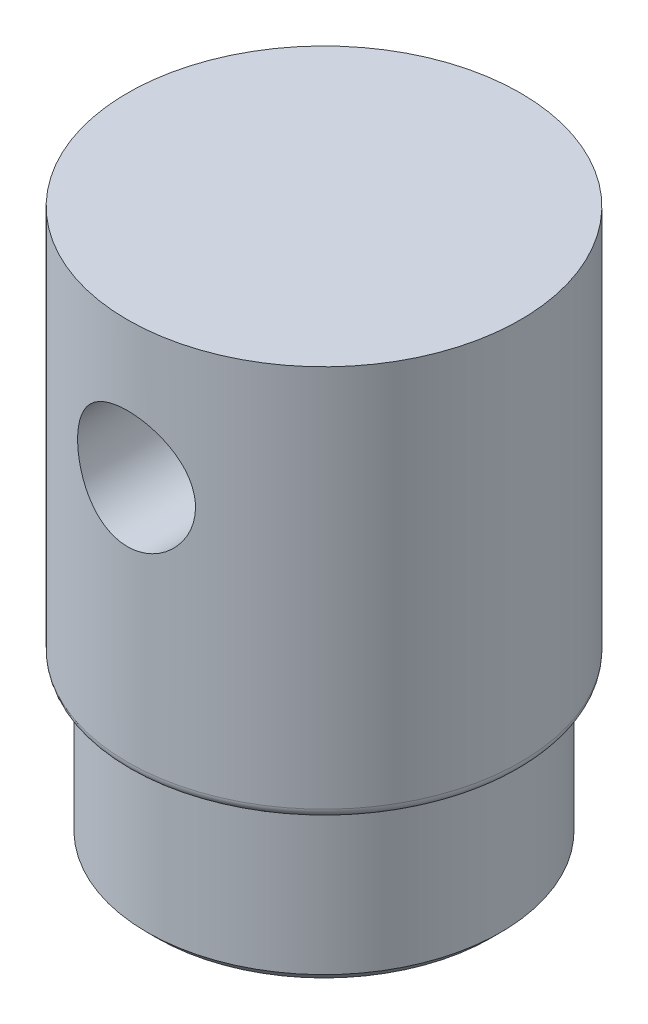
ISO-10303-21;
HEADER;
FILE_DESCRIPTION(('STEP AP214'),'2;1');
FILE_NAME('part.step','',(''),(''),'','','');
FILE_SCHEMA(('AUTOMOTIVE_DESIGN { 1 0 10303 214 1 1 1 1 }'));
ENDSEC;
DATA;
#1=APPLICATION_CONTEXT('core data for automotive mechanical design processes');
#2=APPLICATION_PROTOCOL_DEFINITION('international standard','automotive_design',2000,#1);
#3=PRODUCT_CONTEXT('',#1,'mechanical');
#4=PRODUCT('Part','Part','',(#3));
#5=PRODUCT_RELATED_PRODUCT_CATEGORY('part','',(#4));
#6=PRODUCT_DEFINITION_FORMATION('','',#4);
#7=PRODUCT_DEFINITION_CONTEXT('part definition',#1,'design');
#8=PRODUCT_DEFINITION('design','',#6,#7);
#9=PRODUCT_DEFINITION_SHAPE('','',#8);
#10=(LENGTH_UNIT() NAMED_UNIT(*) SI_UNIT(.MILLI.,.METRE.));
#11=(NAMED_UNIT(*) PLANE_ANGLE_UNIT() SI_UNIT($,.RADIAN.));
#12=(NAMED_UNIT(*) SI_UNIT($,.STERADIAN.) SOLID_ANGLE_UNIT());
#13=UNCERTAINTY_MEASURE_WITH_UNIT(LENGTH_MEASURE(1.E-05),#10,'distance_accuracy_value','');
#14=(GEOMETRIC_REPRESENTATION_CONTEXT(3) GLOBAL_UNCERTAINTY_ASSIGNED_CONTEXT((#13)) GLOBAL_UNIT_ASSIGNED_CONTEXT((#10,
#11,#12)) REPRESENTATION_CONTEXT('',''));
#15=CARTESIAN_POINT('',(0.,0.,0.));
#16=DIRECTION('',(0.,0.,1.));
#17=DIRECTION('',(1.,0.,0.));
#18=AXIS2_PLACEMENT_3D('',#15,#16,#17);
#19=CARTESIAN_POINT('',(0.,20.,0.));
#20=DIRECTION('',(0.,-1.,0.));
#21=DIRECTION('',(0.,0.,-1.));
#22=AXIS2_PLACEMENT_3D('',#19,#20,#21);
#23=CYLINDRICAL_SURFACE('',#22,10.);
#24=CARTESIAN_POINT('',(0.,0.5,0.));
#25=DIRECTION('',(0.,1.,0.));
#26=DIRECTION('',(0.,0.,1.));
#27=AXIS2_PLACEMENT_3D('',#24,#25,#26);
#28=CIRCLE('',#27,10.);
#29=CARTESIAN_POINT('',(0.,0.5,10.));
#30=VERTEX_POINT('',#29);
#31=EDGE_CURVE('E56',#30,#30,#28,.T.);
#32=ORIENTED_EDGE('',*,*,#31,.T.);
#33=EDGE_LOOP('',(#32));
#34=FACE_BOUND('',#33,.T.);
#35=CARTESIAN_POINT('',(0.,16.,-10.));
#36=CARTESIAN_POINT('',(-0.1645772255066,15.9999980050302,-9.99999858501101));
#37=CARTESIAN_POINT('',(-0.329174636703058,15.9864122727521,-9.99589831387907));
#38=CARTESIAN_POINT('',(-0.653576250609761,15.9325572915558,-9.97994211187382));
#39=CARTESIAN_POINT('',(-0.81337900882284,15.8922800839533,-9.96808386779384));
#40=CARTESIAN_POINT('',(-1.12346541550905,15.7865079661795,-9.93791105003673));
#41=CARTESIAN_POINT('',(-1.27376272879074,15.7210502607621,-9.91960600500851));
#42=CARTESIAN_POINT('',(-1.56124836210626,15.5669278138883,-9.87844218475291));
#43=CARTESIAN_POINT('',(-1.69843493493934,15.4782599852092,-9.85558280384133));
#44=CARTESIAN_POINT('',(-1.95974359436749,15.2775519850547,-9.80701474385548));
#45=CARTESIAN_POINT('',(-2.08343614248868,15.1649667482282,-9.78124767314073));
#46=CARTESIAN_POINT('',(-2.31049841846647,14.9207815401796,-9.73011668420884));
#47=CARTESIAN_POINT('',(-2.41386472654882,14.7891783757501,-9.70475283449003));
#48=CARTESIAN_POINT('',(-2.59960075447415,14.5070584939248,-9.65668227987544));
#49=CARTESIAN_POINT('',(-2.68144618044427,14.3561830780185,-9.63404813327749));
#50=CARTESIAN_POINT('',(-2.81842789549521,14.0420214915394,-9.59487240788062));
#51=CARTESIAN_POINT('',(-2.87357059839947,13.878738312144,-9.57832936626621));
#52=CARTESIAN_POINT('',(-2.95403267365303,13.5492194677391,-9.55381741676868));
#53=CARTESIAN_POINT('',(-2.98014392469355,13.3831945122721,-9.54562138649067));
#54=CARTESIAN_POINT('',(-3.00427461229344,13.0489336875665,-9.53805579499534));
#55=CARTESIAN_POINT('',(-3.00230085522157,12.8806983638818,-9.53868409521142));
#56=CARTESIAN_POINT('',(-2.97093954399623,12.553232182783,-9.54849488135555));
#57=CARTESIAN_POINT('',(-2.9425441052537,12.3938954992755,-9.55736777198281));
#58=CARTESIAN_POINT('',(-2.86074840854112,12.0823604274531,-9.58216712457248));
#59=CARTESIAN_POINT('',(-2.80734568283282,11.9301627452513,-9.59809428264701));
#60=CARTESIAN_POINT('',(-2.67632053307363,11.6347993006785,-9.63545466149946));
#61=CARTESIAN_POINT('',(-2.59837633869285,11.4917858320895,-9.65696032231904));
#62=CARTESIAN_POINT('',(-2.42070445177367,11.2205359559796,-9.70301974000129));
#63=CARTESIAN_POINT('',(-2.32097148005177,11.0923031411724,-9.72757423493982));
#64=CARTESIAN_POINT('',(-2.09762581531093,10.848627618476,-9.77822022595875));
#65=CARTESIAN_POINT('',(-1.97318981493394,10.7339426719407,-9.80433308620996));
#66=CARTESIAN_POINT('',(-1.70652651862793,10.5268920318715,-9.85424488126517));
#67=CARTESIAN_POINT('',(-1.56429810372178,10.4345277431711,-9.8780436703682));
#68=CARTESIAN_POINT('',(-1.26471007668561,10.2742801550705,-9.92086320138941));
#69=CARTESIAN_POINT('',(-1.1072554994959,10.2065649675003,-9.93985087336628));
#70=CARTESIAN_POINT('',(-0.782490831207039,10.0988008198007,-9.97067043664444));
#71=CARTESIAN_POINT('',(-0.615183503179164,10.058744142935,-9.98250432373999));
#72=CARTESIAN_POINT('',(-0.281904485336664,10.0086956442012,-9.99736729287077));
#73=CARTESIAN_POINT('',(-0.116100195202375,9.99767682839678,-10.0006970083558));
#74=CARTESIAN_POINT('',(0.214999211646765,10.0031383114242,-9.99905846483519));
#75=CARTESIAN_POINT('',(0.380294393381561,10.0196149393029,-9.99409131355514));
#76=CARTESIAN_POINT('',(0.701807210619393,10.078769222223,-9.97661393974325));
#77=CARTESIAN_POINT('',(0.858145545228338,10.1208467751617,-9.96427659598829));
#78=CARTESIAN_POINT('',(1.16150927790904,10.2292864655564,-9.9334869568307));
#79=CARTESIAN_POINT('',(1.30853355405117,10.2956515220757,-9.91503392642188));
#80=CARTESIAN_POINT('',(1.5928743789221,10.4525063309623,-9.87339308702631));
#81=CARTESIAN_POINT('',(1.72988765239934,10.543518681896,-9.8501056165928));
#82=CARTESIAN_POINT('',(1.9870466159603,10.7464495081056,-9.80146937528705));
#83=CARTESIAN_POINT('',(2.10718806471188,10.8583732237753,-9.7761200886242));
#84=CARTESIAN_POINT('',(2.33171489102052,11.1047746167387,-9.72506343738007));
#85=CARTESIAN_POINT('',(2.43536962463001,11.2399237515437,-9.69937650065513));
#86=CARTESIAN_POINT('',(2.61857990144313,11.5262558780269,-9.65153030477949));
#87=CARTESIAN_POINT('',(2.69813607658965,11.6774384491158,-9.62937095313121));
#88=CARTESIAN_POINT('',(2.83034694254316,11.99106498251,-9.5913437922631));
#89=CARTESIAN_POINT('',(2.88312693874022,12.1534523730757,-9.57544675673501));
#90=CARTESIAN_POINT('',(2.96043461630306,12.4853759378605,-9.55183188739737));
#91=CARTESIAN_POINT('',(2.98497197957849,12.6549096415661,-9.54411125069387));
#92=CARTESIAN_POINT('',(3.0044396896993,12.9887230367768,-9.53799944941558));
#93=CARTESIAN_POINT('',(3.00056110615887,13.1529273020988,-9.53923294700394));
#94=CARTESIAN_POINT('',(2.9661501088861,13.4782282068012,-9.54998802392188));
#95=CARTESIAN_POINT('',(2.93561876249408,13.639324970361,-9.55950927135902));
#96=CARTESIAN_POINT('',(2.84953777608686,13.9518907982633,-9.58551527389243));
#97=CARTESIAN_POINT('',(2.79430351014248,14.1034545747174,-9.60191209104934));
#98=CARTESIAN_POINT('',(2.66063014242147,14.3952848776414,-9.63980557805265));
#99=CARTESIAN_POINT('',(2.58218659925722,14.5355492352831,-9.6613032238508));
#100=CARTESIAN_POINT('',(2.40097527610175,14.8063262330525,-9.70795352855338));
#101=CARTESIAN_POINT('',(2.29742552185996,14.9362975225204,-9.7332108032858));
#102=CARTESIAN_POINT('',(2.07034869259555,15.1774049966162,-9.78402640899066));
#103=CARTESIAN_POINT('',(1.94681643426898,15.2885362789356,-9.80958481647543));
#104=CARTESIAN_POINT('',(1.67893152436652,15.4920468245899,-9.85901873141573));
#105=CARTESIAN_POINT('',(1.53407577158122,15.5837828937109,-9.88282319531422));
#106=CARTESIAN_POINT('',(1.23028274796705,15.7414703398081,-9.92521360911553));
#107=CARTESIAN_POINT('',(1.07135210599791,15.807433776549,-9.94380199862114));
#108=CARTESIAN_POINT('',(0.761515425310566,15.9057905513055,-9.97204349938619));
#109=CARTESIAN_POINT('',(0.61157392390847,15.9410233457665,-9.9824405476214));
#110=CARTESIAN_POINT('',(0.307760390461559,15.9881270504832,-9.9964188898898));
#111=CARTESIAN_POINT('',(0.153889019716279,16.0000018654096,-10.0000013230948));
#112=CARTESIAN_POINT('',(0.,16.,-10.));
#113=B_SPLINE_CURVE_WITH_KNOTS('',3,(#35,#36,#37,#38,#39,#40,#41,#42,#43,#44,#45,#46,#47,#48,
#49,#50,#51,#52,#53,#54,#55,#56,#57,#58,#59,#60,#61,#62,#63,#64,#65,#66,#67,#68,#69,#70,#71,#72,
#73,#74,#75,#76,#77,#78,#79,#80,#81,#82,#83,#84,#85,#86,#87,#88,#89,#90,#91,#92,#93,#94,#95,#96,
#97,#98,#99,#100,#101,#102,#103,#104,#105,#106,#107,#108,#109,#110,#111,#112),.UNSPECIFIED.,.T.,
.F.,(4,2,2,2,2,2,2,2,2,2,2,2,2,2,2,2,2,2,2,2,2,2,2,2,2,2,2,2,2,2,2,2,2,2,2,2,2,2,4),(0.,
0.493166407225221,0.986479929691998,1.47906735260175,1.9717203288254,2.47711205896383,
2.98258874577266,3.49942962008218,4.01614629086447,4.51839378713198,5.02051956638179,
5.50452033395352,5.98856887316003,6.47924852894239,6.97004720317111,7.48134208096333,
7.99266913062143,8.50742093763377,9.02202907057615,9.5181761887709,10.0142570710065,
10.4991349336465,10.9840710918746,11.4802261140582,11.9765056400038,12.4908080064564,
13.0050968850536,13.516956299025,14.0286401892057,14.5190031093854,15.0093463933232,
15.4936008081456,15.9779479511533,16.4799385136898,16.9820594980412,17.4988599232246,
18.0154182319959,18.4766338387004,18.9377723390687),.UNSPECIFIED.);
#114=CARTESIAN_POINT('',(0.,16.,-10.));
#115=VERTEX_POINT('',#114);
#116=EDGE_CURVE('E61',#115,#115,#113,.T.);
#117=ORIENTED_EDGE('',*,*,#116,.T.);
#118=EDGE_LOOP('',(#117));
#119=FACE_BOUND('',#118,.T.);
#120=CARTESIAN_POINT('',(3.,13.,9.53939201416946));
#121=CARTESIAN_POINT('',(2.99999795267528,12.8356109041152,9.5393937145396));
#122=CARTESIAN_POINT('',(2.98644216334284,12.671201551712,9.54368780418137));
#123=CARTESIAN_POINT('',(2.93271688893498,12.3471895008161,9.56033156605799));
#124=CARTESIAN_POINT('',(2.89253851147156,12.1875884269971,9.57268392986936));
#125=CARTESIAN_POINT('',(2.78705506539911,11.8779305434565,9.60392204971265));
#126=CARTESIAN_POINT('',(2.72179178788487,11.7278583407338,9.62279693406465));
#127=CARTESIAN_POINT('',(2.56812843835858,11.4407561320094,9.66493865095134));
#128=CARTESIAN_POINT('',(2.47972490274105,11.3037280826311,9.68820614082039));
#129=CARTESIAN_POINT('',(2.27929508283254,11.0422672188452,9.73733724371531));
#130=CARTESIAN_POINT('',(2.16666414351613,10.9183082041074,9.76325616623271));
#131=CARTESIAN_POINT('',(1.92227247515919,10.690724097355,9.81429723873514));
#132=CARTESIAN_POINT('',(1.79050929092222,10.5871016191002,9.8394192859541));
#133=CARTESIAN_POINT('',(1.50822287558738,10.4010746003334,9.88666429158777));
#134=CARTESIAN_POINT('',(1.35736804267163,10.3191531511144,9.90871448684808));
#135=CARTESIAN_POINT('',(1.0432492907387,10.1820254819145,9.94668871841369));
#136=CARTESIAN_POINT('',(0.879988056775818,10.1268135002851,9.96261407578992));
#137=CARTESIAN_POINT('',(0.550647705261656,10.046239997819,9.98615292007178));
#138=CARTESIAN_POINT('',(0.3847827979076,10.0200697446946,9.99399114738673));
#139=CARTESIAN_POINT('',(0.0508436474986245,9.99576535070712,10.001264030027));
#140=CARTESIAN_POINT('',(-0.117230124100747,9.99762532119609,10.0007004504217));
#141=CARTESIAN_POINT('',(-0.445142313200318,10.028785737086,9.99139207635305));
#142=CARTESIAN_POINT('',(-0.605072535282664,10.0572103876197,9.98290840410475));
#143=CARTESIAN_POINT('',(-0.917778426885079,10.1392626719886,9.95903044225231));
#144=CARTESIAN_POINT('',(-1.07055364264578,10.1928919018855,9.9436357150134));
#145=CARTESIAN_POINT('',(-1.36669465270248,10.324424046837,9.90730441973756));
#146=CARTESIAN_POINT('',(-1.50993012938864,10.4026024056139,9.88630539352772));
#147=CARTESIAN_POINT('',(-1.78152934756663,10.580795704857,9.84099281296778));
#148=CARTESIAN_POINT('',(-1.90988954974545,10.6808158259292,9.81667847277943));
#149=CARTESIAN_POINT('',(-2.15332096305837,10.9043955015009,9.76623100973852));
#150=CARTESIAN_POINT('',(-2.26768916079756,11.0287138380508,9.74006390633503));
#151=CARTESIAN_POINT('',(-2.47415303080115,11.2950200357888,9.68967959784414));
#152=CARTESIAN_POINT('',(-2.56624648967452,11.437009650811,9.66546258669242));
#153=CARTESIAN_POINT('',(-2.72627990669511,11.7364789384722,9.62155806359712));
#154=CARTESIAN_POINT('',(-2.79397978469378,11.8940940916175,9.6019162125849));
#155=CARTESIAN_POINT('',(-2.90166725750739,12.2192144167786,9.5699278496379));
#156=CARTESIAN_POINT('',(-2.94166389279494,12.3867163430351,9.55757895796639));
#157=CARTESIAN_POINT('',(-2.99149540565762,12.7201647215024,9.54209699116239));
#158=CARTESIAN_POINT('',(-3.00239892760807,12.8859364477944,9.53863757349917));
#159=CARTESIAN_POINT('',(-2.99671894465741,13.2169458000133,9.54042384874812));
#160=CARTESIAN_POINT('',(-2.98013928742559,13.38218349746,9.54566832310787));
#161=CARTESIAN_POINT('',(-2.92091527148479,13.7029767559434,9.56395117112153));
#162=CARTESIAN_POINT('',(-2.87895922862587,13.8586723285275,9.57678353015602));
#163=CARTESIAN_POINT('',(-2.77097155495853,14.1608033816294,9.6085828246183));
#164=CARTESIAN_POINT('',(-2.70493620685512,14.307237428281,9.62755070717977));
#165=CARTESIAN_POINT('',(-2.54863742393008,14.5910349281444,9.67011670046268));
#166=CARTESIAN_POINT('',(-2.4577712834546,14.7280494419716,9.69382542139644));
#167=CARTESIAN_POINT('',(-2.25510603200767,14.9852762123616,9.74296411293928));
#168=CARTESIAN_POINT('',(-2.14330191069793,15.1054844352256,9.76839449459994));
#169=CARTESIAN_POINT('',(-1.8969102649872,15.3303608116295,9.81927267096329));
#170=CARTESIAN_POINT('',(-1.76162213171487,15.434271257974,9.84468490126011));
#171=CARTESIAN_POINT('',(-1.47492356918049,15.6179334020555,9.89169703497298));
#172=CARTESIAN_POINT('',(-1.32351394108789,15.6976862995629,9.91329712769433));
#173=CARTESIAN_POINT('',(-1.00987100941044,15.8300000611366,9.95011940949915));
#174=CARTESIAN_POINT('',(-0.847729244075675,15.882764032318,9.96538906849932));
#175=CARTESIAN_POINT('',(-0.516339933009174,15.9601218377808,9.98803959193653));
#176=CARTESIAN_POINT('',(-0.347094434709523,15.9847237318968,9.9954227134176));
#177=CARTESIAN_POINT('',(-0.0133043077654845,16.004446088109,10.001330881628));
#178=CARTESIAN_POINT('',(0.151170358172414,16.0006653908157,10.0001861022264));
#179=CARTESIAN_POINT('',(0.477038962328809,15.9663567350018,9.98994528930073));
#180=CARTESIAN_POINT('',(0.638433074693058,15.9358302930391,9.98084970660925));
#181=CARTESIAN_POINT('',(0.951871626082718,15.8495766772008,9.95582336716653));
#182=CARTESIAN_POINT('',(1.10399785470278,15.794123638702,9.93996705801731));
#183=CARTESIAN_POINT('',(1.39686647550411,15.6598361709856,9.903058860789));
#184=CARTESIAN_POINT('',(1.53760699210116,15.5809978994276,9.88200611899892));
#185=CARTESIAN_POINT('',(1.80860378484113,15.3992530851399,9.83607931656457));
#186=CARTESIAN_POINT('',(1.93838050015354,15.2956571399985,9.81110453847119));
#187=CARTESIAN_POINT('',(2.17907514269189,15.0685792233344,9.76047074424668));
#188=CARTESIAN_POINT('',(2.28998761920387,14.9450915242037,9.73481153282158));
#189=CARTESIAN_POINT('',(2.49312538789097,14.677318443379,9.68481361262638));
#190=CARTESIAN_POINT('',(2.58469519515913,14.5325228932191,9.6605370538697));
#191=CARTESIAN_POINT('',(2.74208627057551,14.228889651678,9.61705095017586));
#192=CARTESIAN_POINT('',(2.80791991114577,14.0700587527976,9.59783897193911));
#193=CARTESIAN_POINT('',(2.90603885065899,13.7605191367875,9.56855633435189));
#194=CARTESIAN_POINT('',(2.94117718022463,13.610782706138,9.5577230968104));
#195=CARTESIAN_POINT('',(2.98815637670288,13.3073695550085,9.54314085194333));
#196=CARTESIAN_POINT('',(3.00000191412191,13.1536936307095,9.53939042442861));
#197=CARTESIAN_POINT('',(3.,13.,9.53939201416946));
#198=B_SPLINE_CURVE_WITH_KNOTS('',3,(#120,#121,#122,#123,#124,#125,#126,#127,#128,#129,#130,
#131,#132,#133,#134,#135,#136,#137,#138,#139,#140,#141,#142,#143,#144,#145,#146,#147,#148,#149,
#150,#151,#152,#153,#154,#155,#156,#157,#158,#159,#160,#161,#162,#163,#164,#165,#166,#167,#168,
#169,#170,#171,#172,#173,#174,#175,#176,#177,#178,#179,#180,#181,#182,#183,#184,#185,#186,#187,
#188,#189,#190,#191,#192,#193,#194,#195,#196,#197),.UNSPECIFIED.,.T.,.F.,(4,2,2,2,2,2,2,2,2,2,2,
2,2,2,2,2,2,2,2,2,2,2,2,2,2,2,2,2,2,2,2,2,2,2,2,2,2,2,4),(0.,0.492600331831085,
0.985365283378001,1.47731282893239,1.9693340507402,2.47546300015968,2.98165695742546,
3.4983187854729,4.01486911175754,4.51664280299116,5.01831108202881,5.50400251981761,
5.98972471780753,6.48110418671353,6.97260033181661,7.48304294046556,7.99353624983726,
8.50892476494934,9.02414501262032,9.52016161585828,10.0161087821999,10.4991718988284,
10.9823096209678,11.4784146362399,11.9746385186306,12.4895901220641,13.0045161465361,
13.5155078363386,14.0263532464857,14.5175260782765,15.0086710610072,15.4945419374965,
15.9804926898797,16.4819925411419,16.9836370526499,17.500232793435,18.016579879331,
18.477223077201,18.9377739007233),.UNSPECIFIED.);
#199=CARTESIAN_POINT('',(3.,13.,9.53939201416946));
#200=VERTEX_POINT('',#199);
#201=EDGE_CURVE('E69',#200,#200,#198,.T.);
#202=ORIENTED_EDGE('',*,*,#201,.T.);
#203=EDGE_LOOP('',(#202));
#204=FACE_BOUND('',#203,.T.);
#205=CARTESIAN_POINT('',(0.,20.,0.));
#206=DIRECTION('',(0.,1.,0.));
#207=DIRECTION('',(0.,0.,1.));
#208=AXIS2_PLACEMENT_3D('',#205,#206,#207);
#209=CIRCLE('',#208,10.);
#210=CARTESIAN_POINT('',(0.,20.,10.));
#211=VERTEX_POINT('',#210);
#212=EDGE_CURVE('E111',#211,#211,#209,.T.);
#213=ORIENTED_EDGE('',*,*,#212,.F.);
#214=EDGE_LOOP('',(#213));
#215=FACE_BOUND('',#214,.T.);
#216=ADVANCED_FACE('F40',(#34,#119,#204,#215),#23,.T.);
#217=CARTESIAN_POINT('',(0.,20.,0.));
#218=DIRECTION('',(0.,1.,0.));
#219=DIRECTION('',(0.,0.,1.));
#220=AXIS2_PLACEMENT_3D('',#217,#218,#219);
#221=PLANE('',#220);
#222=ORIENTED_EDGE('',*,*,#212,.T.);
#223=EDGE_LOOP('',(#222));
#224=FACE_BOUND('',#223,.T.);
#225=ADVANCED_FACE('F90',(#224),#221,.T.);
#226=CARTESIAN_POINT('',(0.,0.,0.));
#227=DIRECTION('',(0.,1.,0.));
#228=DIRECTION('',(0.,0.,1.));
#229=AXIS2_PLACEMENT_3D('',#226,#227,#228);
#230=PLANE('',#229);
#231=CARTESIAN_POINT('',(0.,0.,0.));
#232=DIRECTION('',(0.,1.,0.));
#233=DIRECTION('',(0.,0.,1.));
#234=AXIS2_PLACEMENT_3D('',#231,#232,#233);
#235=CIRCLE('',#234,9.5);
#236=CARTESIAN_POINT('',(0.,0.,9.5));
#237=VERTEX_POINT('',#236);
#238=EDGE_CURVE('E52',#237,#237,#235,.F.);
#239=ORIENTED_EDGE('',*,*,#238,.T.);
#240=EDGE_LOOP('',(#239));
#241=FACE_BOUND('',#240,.T.);
#242=CARTESIAN_POINT('',(0.,0.,0.));
#243=DIRECTION('',(0.,-1.,0.));
#244=DIRECTION('',(0.,0.,-1.));
#245=AXIS2_PLACEMENT_3D('',#242,#243,#244);
#246=CIRCLE('',#245,9.);
#247=CARTESIAN_POINT('',(0.,0.,-9.));
#248=VERTEX_POINT('',#247);
#249=EDGE_CURVE('E112',#248,#248,#246,.T.);
#250=ORIENTED_EDGE('',*,*,#249,.F.);
#251=EDGE_LOOP('',(#250));
#252=FACE_BOUND('',#251,.T.);
#253=ADVANCED_FACE('F89',(#241,#252),#230,.F.);
#254=CARTESIAN_POINT('',(0.,-8.,0.));
#255=DIRECTION('',(0.,1.,0.));
#256=DIRECTION('',(0.,0.,1.));
#257=AXIS2_PLACEMENT_3D('',#254,#255,#256);
#258=CYLINDRICAL_SURFACE('',#257,9.);
#259=CARTESIAN_POINT('',(0.,-7.49999999999999,0.));
#260=DIRECTION('',(0.,-1.,0.));
#261=DIRECTION('',(0.,0.,-1.));
#262=AXIS2_PLACEMENT_3D('',#259,#260,#261);
#263=CIRCLE('',#262,9.);
#264=CARTESIAN_POINT('',(0.,-7.49999999999999,-9.));
#265=VERTEX_POINT('',#264);
#266=EDGE_CURVE('E10',#265,#265,#263,.F.);
#267=ORIENTED_EDGE('',*,*,#266,.T.);
#268=EDGE_LOOP('',(#267));
#269=FACE_BOUND('',#268,.T.);
#270=ORIENTED_EDGE('',*,*,#249,.T.);
#271=EDGE_LOOP('',(#270));
#272=FACE_BOUND('',#271,.T.);
#273=ADVANCED_FACE('F86',(#269,#272),#258,.T.);
#274=CARTESIAN_POINT('',(0.,-8.,0.));
#275=DIRECTION('',(0.,-1.,0.));
#276=DIRECTION('',(0.,0.,-1.));
#277=AXIS2_PLACEMENT_3D('',#274,#275,#276);
#278=PLANE('',#277);
#279=CARTESIAN_POINT('',(0.,-8.,0.));
#280=DIRECTION('',(0.,-1.,0.));
#281=DIRECTION('',(0.,0.,-1.));
#282=AXIS2_PLACEMENT_3D('',#279,#280,#281);
#283=CIRCLE('',#282,8.5);
#284=CARTESIAN_POINT('',(0.,-8.,-8.5));
#285=VERTEX_POINT('',#284);
#286=EDGE_CURVE('E48',#285,#285,#283,.T.);
#287=ORIENTED_EDGE('',*,*,#286,.T.);
#288=EDGE_LOOP('',(#287));
#289=FACE_BOUND('',#288,.T.);
#290=ADVANCED_FACE('F81',(#289),#278,.T.);
#291=CARTESIAN_POINT('',(0.,13.,-10.));
#292=DIRECTION('',(0.,0.,1.));
#293=DIRECTION('',(1.,0.,0.));
#294=AXIS2_PLACEMENT_3D('',#291,#292,#293);
#295=CYLINDRICAL_SURFACE('',#294,3.);
#296=ORIENTED_EDGE('',*,*,#201,.F.);
#297=EDGE_LOOP('',(#296));
#298=FACE_BOUND('',#297,.T.);
#299=ORIENTED_EDGE('',*,*,#116,.F.);
#300=EDGE_LOOP('',(#299));
#301=FACE_BOUND('',#300,.T.);
#302=ADVANCED_FACE('F76',(#298,#301),#295,.F.);
#303=CARTESIAN_POINT('',(0.,0.5,0.));
#304=DIRECTION('',(0.,1.,0.));
#305=DIRECTION('',(0.,0.,1.));
#306=AXIS2_PLACEMENT_3D('',#303,#304,#305);
#307=TOROIDAL_SURFACE('',#306,9.5,0.5);
#308=ORIENTED_EDGE('',*,*,#238,.F.);
#309=EDGE_LOOP('',(#308));
#310=FACE_BOUND('',#309,.T.);
#311=ORIENTED_EDGE('',*,*,#31,.F.);
#312=EDGE_LOOP('',(#311));
#313=FACE_BOUND('',#312,.T.);
#314=ADVANCED_FACE('F80',(#310,#313),#307,.T.);
#315=CARTESIAN_POINT('',(0.,-8.,0.));
#316=DIRECTION('',(0.,1.,0.));
#317=DIRECTION('',(0.,0.,1.));
#318=AXIS2_PLACEMENT_3D('',#315,#316,#317);
#319=CONICAL_SURFACE('',#318,8.5,0.785398163397441);
#320=ORIENTED_EDGE('',*,*,#266,.F.);
#321=EDGE_LOOP('',(#320));
#322=FACE_BOUND('',#321,.T.);
#323=ORIENTED_EDGE('',*,*,#286,.F.);
#324=EDGE_LOOP('',(#323));
#325=FACE_BOUND('',#324,.T.);
#326=ADVANCED_FACE('F43',(#322,#325),#319,.T.);
#327=CLOSED_SHELL('',(#216,#225,#253,#273,#290,#302,#314,#326));
#328=MANIFOLD_SOLID_BREP('B2',#327);
#329=ADVANCED_BREP_SHAPE_REPRESENTATION('',(#18,#328),#14);
#330=SHAPE_DEFINITION_REPRESENTATION(#9,#329);
ENDSEC;
END-ISO-10303-21;
